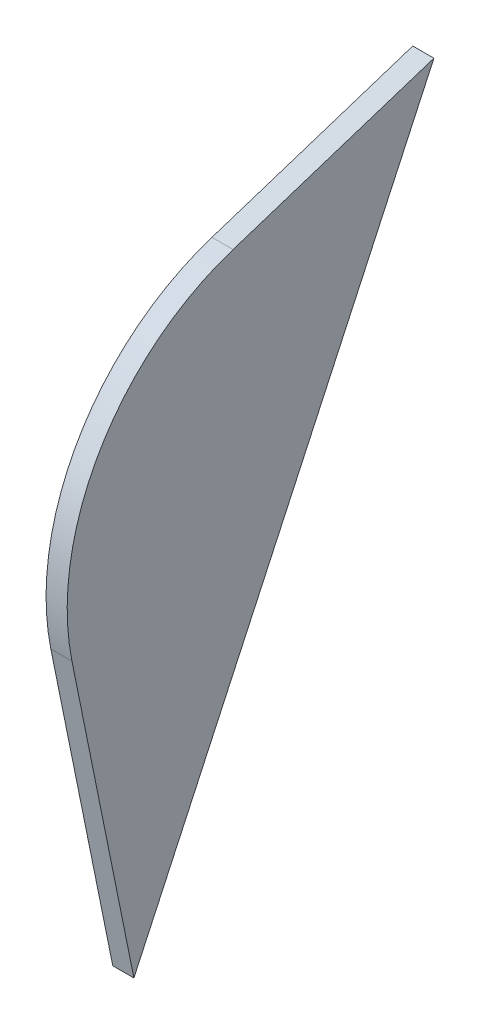
ISO-10303-21;
HEADER;
FILE_DESCRIPTION(('STEP AP214'),'2;1');
FILE_NAME('part.step','',(''),(''),'','','');
FILE_SCHEMA(('AUTOMOTIVE_DESIGN { 1 0 10303 214 1 1 1 1 }'));
ENDSEC;
DATA;
#1=APPLICATION_CONTEXT('core data for automotive mechanical design processes');
#2=APPLICATION_PROTOCOL_DEFINITION('international standard','automotive_design',2000,#1);
#3=PRODUCT_CONTEXT('',#1,'mechanical');
#4=PRODUCT('Part','Part','',(#3));
#5=PRODUCT_RELATED_PRODUCT_CATEGORY('part','',(#4));
#6=PRODUCT_DEFINITION_FORMATION('','',#4);
#7=PRODUCT_DEFINITION_CONTEXT('part definition',#1,'design');
#8=PRODUCT_DEFINITION('design','',#6,#7);
#9=PRODUCT_DEFINITION_SHAPE('','',#8);
#10=(LENGTH_UNIT() NAMED_UNIT(*) SI_UNIT(.MILLI.,.METRE.));
#11=(NAMED_UNIT(*) PLANE_ANGLE_UNIT() SI_UNIT($,.RADIAN.));
#12=(NAMED_UNIT(*) SI_UNIT($,.STERADIAN.) SOLID_ANGLE_UNIT());
#13=UNCERTAINTY_MEASURE_WITH_UNIT(LENGTH_MEASURE(1.E-05),#10,'distance_accuracy_value','');
#14=(GEOMETRIC_REPRESENTATION_CONTEXT(3) GLOBAL_UNCERTAINTY_ASSIGNED_CONTEXT((#13)) GLOBAL_UNIT_ASSIGNED_CONTEXT((#10,
#11,#12)) REPRESENTATION_CONTEXT('',''));
#15=CARTESIAN_POINT('',(0.,0.,0.));
#16=DIRECTION('',(0.,0.,1.));
#17=DIRECTION('',(1.,0.,0.));
#18=AXIS2_PLACEMENT_3D('',#15,#16,#17);
#19=CARTESIAN_POINT('',(3.,-6.91309822448782,-19.3205297240662));
#20=DIRECTION('',(-1.,0.,0.));
#21=DIRECTION('',(0.,0.,1.));
#22=AXIS2_PLACEMENT_3D('',#19,#20,#21);
#23=CYLINDRICAL_SURFACE('',#22,34.0995);
#24=CARTESIAN_POINT('',(0.,-6.91309822448782,-19.3205297240662));
#25=DIRECTION('',(1.,0.,0.));
#26=DIRECTION('',(0.,0.,-1.));
#27=AXIS2_PLACEMENT_3D('',#24,#25,#26);
#28=CIRCLE('',#27,34.0995);
#29=CARTESIAN_POINT('',(0.,25.5181006790276,-8.78519688971208));
#30=VERTEX_POINT('',#29);
#31=CARTESIAN_POINT('',(0.,-13.6905784322946,14.0986513293765));
#32=VERTEX_POINT('',#31);
#33=EDGE_CURVE('E96',#30,#32,#28,.T.);
#34=ORIENTED_EDGE('',*,*,#33,.T.);
#35=DIRECTION('',(-1.,0.,0.));
#36=VECTOR('',#35,1.);
#37=CARTESIAN_POINT('',(3.,-13.6905784322946,14.0986513293765));
#38=LINE('',#37,#36);
#39=CARTESIAN_POINT('',(3.,-13.6905784322946,14.0986513293765));
#40=VERTEX_POINT('',#39);
#41=EDGE_CURVE('E11',#40,#32,#38,.T.);
#42=ORIENTED_EDGE('',*,*,#41,.F.);
#43=CARTESIAN_POINT('',(3.,-6.91309822448782,-19.3205297240662));
#44=DIRECTION('',(1.,0.,0.));
#45=DIRECTION('',(0.,0.,-1.));
#46=AXIS2_PLACEMENT_3D('',#43,#44,#45);
#47=CIRCLE('',#46,34.0995);
#48=CARTESIAN_POINT('',(3.,25.5181006790276,-8.78519688971208));
#49=VERTEX_POINT('',#48);
#50=EDGE_CURVE('E84',#49,#40,#47,.T.);
#51=ORIENTED_EDGE('',*,*,#50,.F.);
#52=DIRECTION('',(-1.,0.,0.));
#53=VECTOR('',#52,1.);
#54=CARTESIAN_POINT('',(3.,25.5181006790276,-8.78519688971208));
#55=LINE('',#54,#53);
#56=EDGE_CURVE('E92',#49,#30,#55,.T.);
#57=ORIENTED_EDGE('',*,*,#56,.T.);
#58=EDGE_LOOP('',(#34,#42,#51,#57));
#59=FACE_BOUND('',#58,.T.);
#60=ADVANCED_FACE('F33',(#59),#23,.T.);
#61=CARTESIAN_POINT('',(3.,-57.0601906408262,5.30320275469343));
#62=DIRECTION('',(0.,0.198755999583771,-0.980049005218339));
#63=DIRECTION('',(0.,0.980049005218339,0.198755999583771));
#64=AXIS2_PLACEMENT_3D('',#61,#62,#63);
#65=PLANE('',#64);
#66=DIRECTION('',(0.,-0.980049005218339,-0.198755999583771));
#67=VECTOR('',#66,1.);
#68=CARTESIAN_POINT('',(0.,-57.0601906408262,5.30320275469343));
#69=LINE('',#68,#67);
#70=CARTESIAN_POINT('',(0.,-57.0601906408262,5.30320275469343));
#71=VERTEX_POINT('',#70);
#72=EDGE_CURVE('E88',#32,#71,#69,.T.);
#73=ORIENTED_EDGE('',*,*,#72,.T.);
#74=DIRECTION('',(-1.,0.,0.));
#75=VECTOR('',#74,1.);
#76=CARTESIAN_POINT('',(3.,-57.0601906408262,5.30320275469343));
#77=LINE('',#76,#75);
#78=CARTESIAN_POINT('',(3.,-57.0601906408262,5.30320275469343));
#79=VERTEX_POINT('',#78);
#80=EDGE_CURVE('E41',#79,#71,#77,.T.);
#81=ORIENTED_EDGE('',*,*,#80,.F.);
#82=DIRECTION('',(0.,-0.980049005218339,-0.198755999583771));
#83=VECTOR('',#82,1.);
#84=CARTESIAN_POINT('',(3.,-57.0601906408262,5.30320275469343));
#85=LINE('',#84,#83);
#86=EDGE_CURVE('E79',#40,#79,#85,.T.);
#87=ORIENTED_EDGE('',*,*,#86,.F.);
#88=ORIENTED_EDGE('',*,*,#41,.T.);
#89=EDGE_LOOP('',(#73,#81,#87,#88));
#90=FACE_BOUND('',#89,.T.);
#91=ADVANCED_FACE('F87',(#90),#65,.F.);
#92=CARTESIAN_POINT('',(3.,34.7868578464531,-37.3174617940496));
#93=DIRECTION('',(0.,0.420927613619625,0.90709423109867));
#94=DIRECTION('',(0.,-0.90709423109867,0.420927613619625));
#95=AXIS2_PLACEMENT_3D('',#92,#93,#94);
#96=PLANE('',#95);
#97=DIRECTION('',(0.,0.90709423109867,-0.420927613619625));
#98=VECTOR('',#97,1.);
#99=CARTESIAN_POINT('',(0.,34.7868578464531,-37.3174617940496));
#100=LINE('',#99,#98);
#101=CARTESIAN_POINT('',(0.,34.7868578464531,-37.3174617940496));
#102=VERTEX_POINT('',#101);
#103=EDGE_CURVE('E66',#71,#102,#100,.T.);
#104=ORIENTED_EDGE('',*,*,#103,.T.);
#105=DIRECTION('',(-1.,0.,0.));
#106=VECTOR('',#105,1.);
#107=CARTESIAN_POINT('',(3.,34.7868578464531,-37.3174617940496));
#108=LINE('',#107,#106);
#109=CARTESIAN_POINT('',(3.,34.7868578464531,-37.3174617940496));
#110=VERTEX_POINT('',#109);
#111=EDGE_CURVE('E89',#110,#102,#108,.T.);
#112=ORIENTED_EDGE('',*,*,#111,.F.);
#113=DIRECTION('',(0.,0.90709423109867,-0.420927613619625));
#114=VECTOR('',#113,1.);
#115=CARTESIAN_POINT('',(3.,34.7868578464531,-37.3174617940496));
#116=LINE('',#115,#114);
#117=EDGE_CURVE('E82',#79,#110,#116,.T.);
#118=ORIENTED_EDGE('',*,*,#117,.F.);
#119=ORIENTED_EDGE('',*,*,#80,.T.);
#120=EDGE_LOOP('',(#104,#112,#118,#119));
#121=FACE_BOUND('',#120,.T.);
#122=ADVANCED_FACE('F90',(#121),#96,.F.);
#123=CARTESIAN_POINT('',(3.,25.5181006790276,-8.78519688971208));
#124=DIRECTION('',(0.,-0.951075496811255,-0.308958572247517));
#125=DIRECTION('',(0.,0.308958572247517,-0.951075496811255));
#126=AXIS2_PLACEMENT_3D('',#123,#124,#125);
#127=PLANE('',#126);
#128=DIRECTION('',(0.,-0.308958572247517,0.951075496811255));
#129=VECTOR('',#128,1.);
#130=CARTESIAN_POINT('',(0.,25.5181006790276,-8.78519688971208));
#131=LINE('',#130,#129);
#132=EDGE_CURVE('E72',#102,#30,#131,.T.);
#133=ORIENTED_EDGE('',*,*,#132,.T.);
#134=ORIENTED_EDGE('',*,*,#56,.F.);
#135=DIRECTION('',(0.,-0.308958572247517,0.951075496811255));
#136=VECTOR('',#135,1.);
#137=CARTESIAN_POINT('',(3.,25.5181006790276,-8.78519688971208));
#138=LINE('',#137,#136);
#139=EDGE_CURVE('E49',#110,#49,#138,.T.);
#140=ORIENTED_EDGE('',*,*,#139,.F.);
#141=ORIENTED_EDGE('',*,*,#111,.T.);
#142=EDGE_LOOP('',(#133,#134,#140,#141));
#143=FACE_BOUND('',#142,.T.);
#144=ADVANCED_FACE('F103',(#143),#127,.F.);
#145=CARTESIAN_POINT('',(3.,-6.91309822448782,-19.3205297240662));
#146=DIRECTION('',(1.,0.,0.));
#147=DIRECTION('',(0.,0.,-1.));
#148=AXIS2_PLACEMENT_3D('',#145,#146,#147);
#149=PLANE('',#148);
#150=ORIENTED_EDGE('',*,*,#50,.T.);
#151=ORIENTED_EDGE('',*,*,#86,.T.);
#152=ORIENTED_EDGE('',*,*,#117,.T.);
#153=ORIENTED_EDGE('',*,*,#139,.T.);
#154=EDGE_LOOP('',(#150,#151,#152,#153));
#155=FACE_BOUND('',#154,.T.);
#156=ADVANCED_FACE('F80',(#155),#149,.T.);
#157=CARTESIAN_POINT('',(0.,-6.91309822448782,-19.3205297240662));
#158=DIRECTION('',(1.,0.,0.));
#159=DIRECTION('',(0.,0.,-1.));
#160=AXIS2_PLACEMENT_3D('',#157,#158,#159);
#161=PLANE('',#160);
#162=ORIENTED_EDGE('',*,*,#33,.F.);
#163=ORIENTED_EDGE('',*,*,#132,.F.);
#164=ORIENTED_EDGE('',*,*,#103,.F.);
#165=ORIENTED_EDGE('',*,*,#72,.F.);
#166=EDGE_LOOP('',(#162,#163,#164,#165));
#167=FACE_BOUND('',#166,.T.);
#168=ADVANCED_FACE('F106',(#167),#161,.F.);
#169=CLOSED_SHELL('',(#60,#91,#122,#144,#156,#168));
#170=MANIFOLD_SOLID_BREP('B2',#169);
#171=ADVANCED_BREP_SHAPE_REPRESENTATION('',(#18,#170),#14);
#172=SHAPE_DEFINITION_REPRESENTATION(#9,#171);
ENDSEC;
END-ISO-10303-21;
